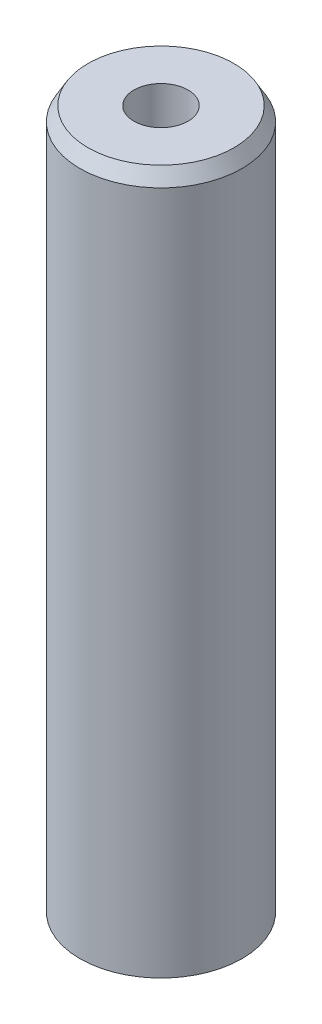
ISO-10303-21;
HEADER;
FILE_DESCRIPTION(('STEP AP214'),'2;1');
FILE_NAME('part.step','',(''),(''),'','','');
FILE_SCHEMA(('AUTOMOTIVE_DESIGN { 1 0 10303 214 1 1 1 1 }'));
ENDSEC;
DATA;
#1=APPLICATION_CONTEXT('core data for automotive mechanical design processes');
#2=APPLICATION_PROTOCOL_DEFINITION('international standard','automotive_design',2000,#1);
#3=PRODUCT_CONTEXT('',#1,'mechanical');
#4=PRODUCT('Part','Part','',(#3));
#5=PRODUCT_RELATED_PRODUCT_CATEGORY('part','',(#4));
#6=PRODUCT_DEFINITION_FORMATION('','',#4);
#7=PRODUCT_DEFINITION_CONTEXT('part definition',#1,'design');
#8=PRODUCT_DEFINITION('design','',#6,#7);
#9=PRODUCT_DEFINITION_SHAPE('','',#8);
#10=(LENGTH_UNIT() NAMED_UNIT(*) SI_UNIT(.MILLI.,.METRE.));
#11=(NAMED_UNIT(*) PLANE_ANGLE_UNIT() SI_UNIT($,.RADIAN.));
#12=(NAMED_UNIT(*) SI_UNIT($,.STERADIAN.) SOLID_ANGLE_UNIT());
#13=UNCERTAINTY_MEASURE_WITH_UNIT(LENGTH_MEASURE(1.E-05),#10,'distance_accuracy_value','');
#14=(GEOMETRIC_REPRESENTATION_CONTEXT(3) GLOBAL_UNCERTAINTY_ASSIGNED_CONTEXT((#13)) GLOBAL_UNIT_ASSIGNED_CONTEXT((#10,
#11,#12)) REPRESENTATION_CONTEXT('',''));
#15=CARTESIAN_POINT('',(0.,0.,0.));
#16=DIRECTION('',(0.,0.,1.));
#17=DIRECTION('',(1.,0.,0.));
#18=AXIS2_PLACEMENT_3D('',#15,#16,#17);
#19=CARTESIAN_POINT('',(0.,43.5639559172972,0.));
#20=DIRECTION('',(0.,-1.,0.));
#21=DIRECTION('',(0.,0.,-1.));
#22=AXIS2_PLACEMENT_3D('',#19,#20,#21);
#23=CYLINDRICAL_SURFACE('',#22,5.);
#24=CARTESIAN_POINT('',(0.,42.7019356912873,0.));
#25=DIRECTION('',(0.,1.,0.));
#26=DIRECTION('',(0.,0.,1.));
#27=AXIS2_PLACEMENT_3D('',#24,#25,#26);
#28=CIRCLE('',#27,5.);
#29=CARTESIAN_POINT('',(0.,42.7019356912873,5.));
#30=VERTEX_POINT('',#29);
#31=EDGE_CURVE('E50',#30,#30,#28,.F.);
#32=ORIENTED_EDGE('',*,*,#31,.T.);
#33=EDGE_LOOP('',(#32));
#34=FACE_BOUND('',#33,.T.);
#35=CARTESIAN_POINT('',(0.,0.497687609533698,0.));
#36=DIRECTION('',(0.,1.,0.));
#37=DIRECTION('',(0.,0.,1.));
#38=AXIS2_PLACEMENT_3D('',#35,#36,#37);
#39=CIRCLE('',#38,5.);
#40=CARTESIAN_POINT('',(0.,0.497687609533698,5.));
#41=VERTEX_POINT('',#40);
#42=EDGE_CURVE('E51',#41,#41,#39,.T.);
#43=ORIENTED_EDGE('',*,*,#42,.T.);
#44=EDGE_LOOP('',(#43));
#45=FACE_BOUND('',#44,.T.);
#46=ADVANCED_FACE('F39',(#34,#45),#23,.T.);
#47=CARTESIAN_POINT('',(0.,43.5639559172972,0.));
#48=DIRECTION('',(0.,1.,0.));
#49=DIRECTION('',(0.,0.,1.));
#50=AXIS2_PLACEMENT_3D('',#47,#48,#49);
#51=PLANE('',#50);
#52=CARTESIAN_POINT('',(0.,43.5639559172972,0.));
#53=DIRECTION('',(0.,1.,0.));
#54=DIRECTION('',(0.,0.,1.));
#55=AXIS2_PLACEMENT_3D('',#52,#53,#54);
#56=CIRCLE('',#55,4.5023123904663);
#57=CARTESIAN_POINT('',(0.,43.5639559172972,4.5023123904663));
#58=VERTEX_POINT('',#57);
#59=EDGE_CURVE('E54',#58,#58,#56,.T.);
#60=ORIENTED_EDGE('',*,*,#59,.T.);
#61=EDGE_LOOP('',(#60));
#62=FACE_BOUND('',#61,.T.);
#63=CARTESIAN_POINT('',(0.,43.5639559172972,0.));
#64=DIRECTION('',(0.,1.,0.));
#65=DIRECTION('',(0.,0.,1.));
#66=AXIS2_PLACEMENT_3D('',#63,#64,#65);
#67=CIRCLE('',#66,1.66969072340228);
#68=CARTESIAN_POINT('',(0.,43.5639559172972,1.66969072340228));
#69=VERTEX_POINT('',#68);
#70=EDGE_CURVE('E58',#69,#69,#67,.T.);
#71=ORIENTED_EDGE('',*,*,#70,.F.);
#72=EDGE_LOOP('',(#71));
#73=FACE_BOUND('',#72,.T.);
#74=ADVANCED_FACE('F69',(#62,#73),#51,.T.);
#75=CARTESIAN_POINT('',(0.,0.,0.));
#76=DIRECTION('',(0.,1.,0.));
#77=DIRECTION('',(0.,0.,1.));
#78=AXIS2_PLACEMENT_3D('',#75,#76,#77);
#79=PLANE('',#78);
#80=CARTESIAN_POINT('',(0.,0.,0.));
#81=DIRECTION('',(0.,1.,0.));
#82=DIRECTION('',(0.,0.,1.));
#83=AXIS2_PLACEMENT_3D('',#80,#81,#82);
#84=CIRCLE('',#83,4.13797977399013);
#85=CARTESIAN_POINT('',(0.,0.,4.13797977399013));
#86=VERTEX_POINT('',#85);
#87=EDGE_CURVE('E10',#86,#86,#84,.F.);
#88=ORIENTED_EDGE('',*,*,#87,.T.);
#89=EDGE_LOOP('',(#88));
#90=FACE_BOUND('',#89,.T.);
#91=CARTESIAN_POINT('',(0.,0.,0.));
#92=DIRECTION('',(0.,1.,0.));
#93=DIRECTION('',(0.,0.,1.));
#94=AXIS2_PLACEMENT_3D('',#91,#92,#93);
#95=CIRCLE('',#94,1.66969072340228);
#96=CARTESIAN_POINT('',(0.,0.,1.66969072340228));
#97=VERTEX_POINT('',#96);
#98=EDGE_CURVE('E63',#97,#97,#95,.T.);
#99=ORIENTED_EDGE('',*,*,#98,.T.);
#100=EDGE_LOOP('',(#99));
#101=FACE_BOUND('',#100,.T.);
#102=ADVANCED_FACE('F75',(#90,#101),#79,.F.);
#103=CARTESIAN_POINT('',(0.,43.5639559172972,0.));
#104=DIRECTION('',(0.,-1.,0.));
#105=DIRECTION('',(0.,0.,-1.));
#106=AXIS2_PLACEMENT_3D('',#103,#104,#105);
#107=CYLINDRICAL_SURFACE('',#106,1.66969072340228);
#108=ORIENTED_EDGE('',*,*,#70,.T.);
#109=EDGE_LOOP('',(#108));
#110=FACE_BOUND('',#109,.T.);
#111=ORIENTED_EDGE('',*,*,#98,.F.);
#112=EDGE_LOOP('',(#111));
#113=FACE_BOUND('',#112,.T.);
#114=ADVANCED_FACE('F70',(#110,#113),#107,.F.);
#115=CARTESIAN_POINT('',(0.,43.5639559172972,0.));
#116=DIRECTION('',(0.,-1.,0.));
#117=DIRECTION('',(0.,0.,-1.));
#118=AXIS2_PLACEMENT_3D('',#115,#116,#117);
#119=CONICAL_SURFACE('',#118,4.5023123904663,0.523598775598296);
#120=ORIENTED_EDGE('',*,*,#31,.F.);
#121=EDGE_LOOP('',(#120));
#122=FACE_BOUND('',#121,.T.);
#123=ORIENTED_EDGE('',*,*,#59,.F.);
#124=EDGE_LOOP('',(#123));
#125=FACE_BOUND('',#124,.T.);
#126=ADVANCED_FACE('F81',(#122,#125),#119,.T.);
#127=CARTESIAN_POINT('',(0.,0.497687609533698,0.));
#128=DIRECTION('',(0.,1.,0.));
#129=DIRECTION('',(0.,0.,1.));
#130=AXIS2_PLACEMENT_3D('',#127,#128,#129);
#131=CONICAL_SURFACE('',#130,5.,1.0471975511966);
#132=ORIENTED_EDGE('',*,*,#87,.F.);
#133=EDGE_LOOP('',(#132));
#134=FACE_BOUND('',#133,.T.);
#135=ORIENTED_EDGE('',*,*,#42,.F.);
#136=EDGE_LOOP('',(#135));
#137=FACE_BOUND('',#136,.T.);
#138=ADVANCED_FACE('F45',(#134,#137),#131,.T.);
#139=CLOSED_SHELL('',(#46,#74,#102,#114,#126,#138));
#140=MANIFOLD_SOLID_BREP('B2',#139);
#141=ADVANCED_BREP_SHAPE_REPRESENTATION('',(#18,#140),#14);
#142=SHAPE_DEFINITION_REPRESENTATION(#9,#141);
ENDSEC;
END-ISO-10303-21;
